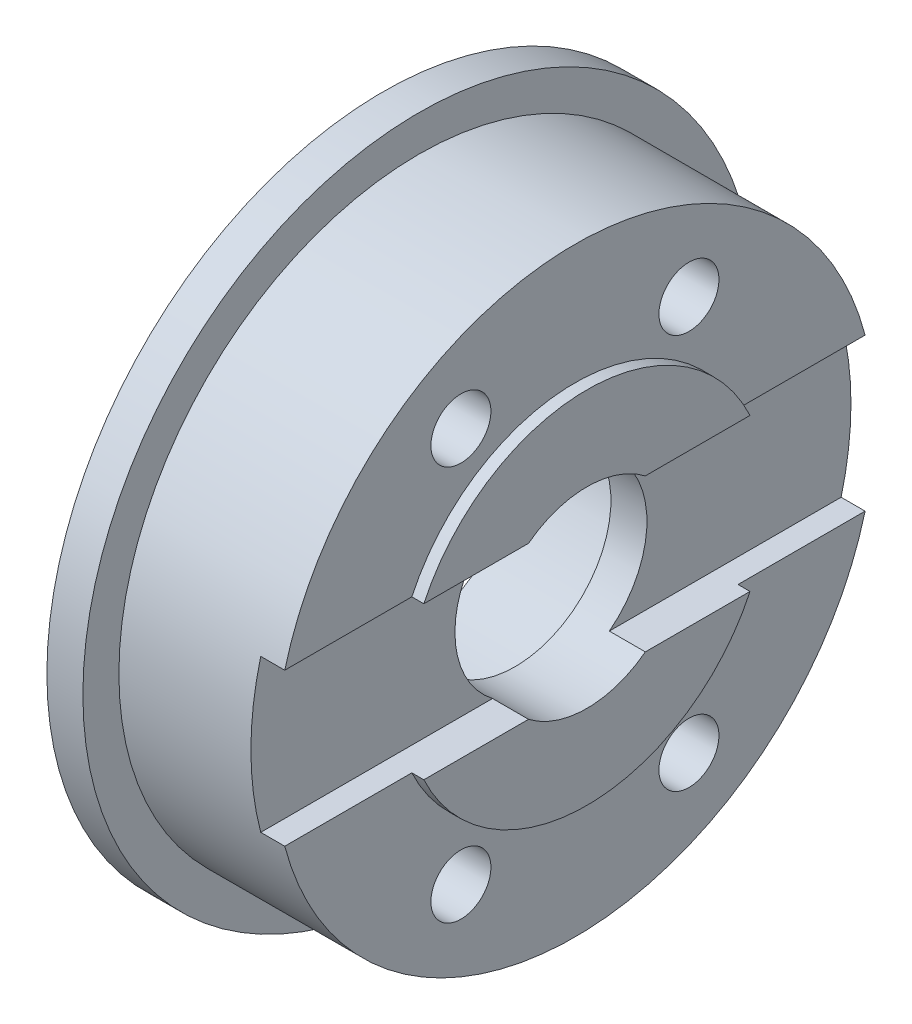
ISO-10303-21;
HEADER;
FILE_DESCRIPTION(('STEP AP214'),'2;1');
FILE_NAME('part.step','',(''),(''),'','','');
FILE_SCHEMA(('AUTOMOTIVE_DESIGN { 1 0 10303 214 1 1 1 1 }'));
ENDSEC;
DATA;
#1=APPLICATION_CONTEXT('core data for automotive mechanical design processes');
#2=APPLICATION_PROTOCOL_DEFINITION('international standard','automotive_design',2000,#1);
#3=PRODUCT_CONTEXT('',#1,'mechanical');
#4=PRODUCT('Part','Part','',(#3));
#5=PRODUCT_RELATED_PRODUCT_CATEGORY('part','',(#4));
#6=PRODUCT_DEFINITION_FORMATION('','',#4);
#7=PRODUCT_DEFINITION_CONTEXT('part definition',#1,'design');
#8=PRODUCT_DEFINITION('design','',#6,#7);
#9=PRODUCT_DEFINITION_SHAPE('','',#8);
#10=(LENGTH_UNIT() NAMED_UNIT(*) SI_UNIT(.MILLI.,.METRE.));
#11=(NAMED_UNIT(*) PLANE_ANGLE_UNIT() SI_UNIT($,.RADIAN.));
#12=(NAMED_UNIT(*) SI_UNIT($,.STERADIAN.) SOLID_ANGLE_UNIT());
#13=UNCERTAINTY_MEASURE_WITH_UNIT(LENGTH_MEASURE(1.E-05),#10,'distance_accuracy_value','');
#14=(GEOMETRIC_REPRESENTATION_CONTEXT(3) GLOBAL_UNCERTAINTY_ASSIGNED_CONTEXT((#13)) GLOBAL_UNIT_ASSIGNED_CONTEXT((#10,
#11,#12)) REPRESENTATION_CONTEXT('',''));
#15=CARTESIAN_POINT('',(0.,0.,0.));
#16=DIRECTION('',(0.,0.,1.));
#17=DIRECTION('',(1.,0.,0.));
#18=AXIS2_PLACEMENT_3D('',#15,#16,#17);
#19=CARTESIAN_POINT('',(-5.5,4.,0.));
#20=DIRECTION('',(-1.,0.,0.));
#21=DIRECTION('',(0.,0.,1.));
#22=AXIS2_PLACEMENT_3D('',#19,#20,#21);
#23=PLANE('',#22);
#24=DIRECTION('',(0.,0.,1.));
#25=VECTOR('',#24,1.);
#26=CARTESIAN_POINT('',(-5.5,3.175,0.));
#27=LINE('',#26,#25);
#28=CARTESIAN_POINT('',(-5.5,3.175,-6.79480500088119));
#29=VERTEX_POINT('',#28);
#30=CARTESIAN_POINT('',(-5.5,3.175,-2.43297657202037));
#31=VERTEX_POINT('',#30);
#32=EDGE_CURVE('E169',#29,#31,#27,.T.);
#33=ORIENTED_EDGE('',*,*,#32,.F.);
#34=CARTESIAN_POINT('',(-5.5,0.,0.));
#35=DIRECTION('',(-1.,0.,0.));
#36=DIRECTION('',(0.,0.,1.));
#37=AXIS2_PLACEMENT_3D('',#34,#35,#36);
#38=CIRCLE('',#37,7.5);
#39=CARTESIAN_POINT('',(-5.5,3.175,6.79480500088119));
#40=VERTEX_POINT('',#39);
#41=EDGE_CURVE('E181',#40,#29,#38,.T.);
#42=ORIENTED_EDGE('',*,*,#41,.F.);
#43=CARTESIAN_POINT('',(-5.5,3.175,2.43297657202037));
#44=VERTEX_POINT('',#43);
#45=EDGE_CURVE('E172',#44,#40,#27,.T.);
#46=ORIENTED_EDGE('',*,*,#45,.F.);
#47=CARTESIAN_POINT('',(-5.5,0.,0.));
#48=DIRECTION('',(-1.,0.,0.));
#49=DIRECTION('',(0.,0.,1.));
#50=AXIS2_PLACEMENT_3D('',#47,#48,#49);
#51=CIRCLE('',#50,4.);
#52=EDGE_CURVE('E211',#44,#31,#51,.T.);
#53=ORIENTED_EDGE('',*,*,#52,.T.);
#54=EDGE_LOOP('',(#33,#42,#46,#53));
#55=FACE_BOUND('',#54,.T.);
#56=ADVANCED_FACE('F45',(#55),#23,.F.);
#57=DIRECTION('',(0.,0.,-1.));
#58=VECTOR('',#57,1.);
#59=CARTESIAN_POINT('',(-5.5,-3.175,0.));
#60=LINE('',#59,#58);
#61=CARTESIAN_POINT('',(-5.5,-3.175,6.79480500088119));
#62=VERTEX_POINT('',#61);
#63=CARTESIAN_POINT('',(-5.5,-3.175,2.43297657202037));
#64=VERTEX_POINT('',#63);
#65=EDGE_CURVE('E153',#62,#64,#60,.T.);
#66=ORIENTED_EDGE('',*,*,#65,.F.);
#67=CARTESIAN_POINT('',(-5.5,-3.175,-6.79480500088119));
#68=VERTEX_POINT('',#67);
#69=EDGE_CURVE('E185',#68,#62,#38,.T.);
#70=ORIENTED_EDGE('',*,*,#69,.F.);
#71=CARTESIAN_POINT('',(-5.5,-3.175,-2.43297657202037));
#72=VERTEX_POINT('',#71);
#73=EDGE_CURVE('E59',#72,#68,#60,.T.);
#74=ORIENTED_EDGE('',*,*,#73,.F.);
#75=EDGE_CURVE('E210',#72,#64,#51,.T.);
#76=ORIENTED_EDGE('',*,*,#75,.T.);
#77=EDGE_LOOP('',(#66,#70,#74,#76));
#78=FACE_BOUND('',#77,.T.);
#79=ADVANCED_FACE('F323',(#78),#23,.F.);
#80=CARTESIAN_POINT('',(-22.0709534368071,0.,0.));
#81=DIRECTION('',(-1.,0.,0.));
#82=DIRECTION('',(0.,0.,1.));
#83=AXIS2_PLACEMENT_3D('',#80,#81,#82);
#84=CYLINDRICAL_SURFACE('',#83,4.);
#85=CARTESIAN_POINT('',(-8.5,0.,0.));
#86=DIRECTION('',(-1.,0.,0.));
#87=DIRECTION('',(0.,0.,1.));
#88=AXIS2_PLACEMENT_3D('',#85,#86,#87);
#89=CIRCLE('',#88,4.);
#90=CARTESIAN_POINT('',(-8.5,0.,4.));
#91=VERTEX_POINT('',#90);
#92=EDGE_CURVE('E207',#91,#91,#89,.T.);
#93=ORIENTED_EDGE('',*,*,#92,.T.);
#94=EDGE_LOOP('',(#93));
#95=FACE_BOUND('',#94,.T.);
#96=DIRECTION('',(-1.,0.,0.));
#97=VECTOR('',#96,1.);
#98=CARTESIAN_POINT('',(-22.0709534368071,3.175,2.43297657202037));
#99=LINE('',#98,#97);
#100=CARTESIAN_POINT('',(-7.,3.175,2.43297657202037));
#101=VERTEX_POINT('',#100);
#102=EDGE_CURVE('E176',#101,#44,#99,.F.);
#103=ORIENTED_EDGE('',*,*,#102,.F.);
#104=CARTESIAN_POINT('',(-7.,0.,0.));
#105=DIRECTION('',(1.,0.,0.));
#106=DIRECTION('',(0.,0.,-1.));
#107=AXIS2_PLACEMENT_3D('',#104,#105,#106);
#108=CIRCLE('',#107,4.);
#109=CARTESIAN_POINT('',(-7.,-3.175,2.43297657202037));
#110=VERTEX_POINT('',#109);
#111=EDGE_CURVE('E180',#110,#101,#108,.F.);
#112=ORIENTED_EDGE('',*,*,#111,.F.);
#113=DIRECTION('',(-1.,0.,0.));
#114=VECTOR('',#113,1.);
#115=CARTESIAN_POINT('',(-22.0709534368071,-3.175,2.43297657202037));
#116=LINE('',#115,#114);
#117=EDGE_CURVE('E145',#64,#110,#116,.T.);
#118=ORIENTED_EDGE('',*,*,#117,.F.);
#119=ORIENTED_EDGE('',*,*,#75,.F.);
#120=DIRECTION('',(-1.,0.,0.));
#121=VECTOR('',#120,1.);
#122=CARTESIAN_POINT('',(-22.0709534368071,-3.175,-2.43297657202037));
#123=LINE('',#122,#121);
#124=CARTESIAN_POINT('',(-7.,-3.175,-2.43297657202037));
#125=VERTEX_POINT('',#124);
#126=EDGE_CURVE('E162',#125,#72,#123,.F.);
#127=ORIENTED_EDGE('',*,*,#126,.F.);
#128=CARTESIAN_POINT('',(-7.,3.175,-2.43297657202037));
#129=VERTEX_POINT('',#128);
#130=EDGE_CURVE('E178',#129,#125,#108,.F.);
#131=ORIENTED_EDGE('',*,*,#130,.F.);
#132=DIRECTION('',(-1.,0.,0.));
#133=VECTOR('',#132,1.);
#134=CARTESIAN_POINT('',(-22.0709534368071,3.175,-2.43297657202037));
#135=LINE('',#134,#133);
#136=EDGE_CURVE('E171',#31,#129,#135,.T.);
#137=ORIENTED_EDGE('',*,*,#136,.F.);
#138=ORIENTED_EDGE('',*,*,#52,.F.);
#139=EDGE_LOOP('',(#103,#112,#118,#119,#127,#131,#137,#138));
#140=FACE_BOUND('',#139,.T.);
#141=ADVANCED_FACE('F252',(#95,#140),#84,.F.);
#142=CARTESIAN_POINT('',(-22.0709534368071,0.,0.));
#143=DIRECTION('',(-1.,0.,0.));
#144=DIRECTION('',(0.,0.,1.));
#145=AXIS2_PLACEMENT_3D('',#142,#143,#144);
#146=CYLINDRICAL_SURFACE('',#145,12.5);
#147=CARTESIAN_POINT('',(-12.5,0.,0.));
#148=DIRECTION('',(-1.,0.,0.));
#149=DIRECTION('',(0.,0.,1.));
#150=AXIS2_PLACEMENT_3D('',#147,#148,#149);
#151=CIRCLE('',#150,12.5);
#152=CARTESIAN_POINT('',(-12.5,0.,12.5));
#153=VERTEX_POINT('',#152);
#154=EDGE_CURVE('E192',#153,#153,#151,.T.);
#155=ORIENTED_EDGE('',*,*,#154,.F.);
#156=EDGE_LOOP('',(#155));
#157=FACE_BOUND('',#156,.T.);
#158=DIRECTION('',(-1.,0.,0.));
#159=VECTOR('',#158,1.);
#160=CARTESIAN_POINT('',(-22.0709534368071,3.175,12.0900527294135));
#161=LINE('',#160,#159);
#162=CARTESIAN_POINT('',(-6.,3.175,12.0900527294135));
#163=VERTEX_POINT('',#162);
#164=CARTESIAN_POINT('',(-7.,3.175,12.0900527294135));
#165=VERTEX_POINT('',#164);
#166=EDGE_CURVE('E174',#163,#165,#161,.T.);
#167=ORIENTED_EDGE('',*,*,#166,.F.);
#168=CARTESIAN_POINT('',(-6.,0.,0.));
#169=DIRECTION('',(-1.,0.,0.));
#170=DIRECTION('',(0.,0.,1.));
#171=AXIS2_PLACEMENT_3D('',#168,#169,#170);
#172=CIRCLE('',#171,12.5);
#173=CARTESIAN_POINT('',(-6.,3.175,-12.0900527294135));
#174=VERTEX_POINT('',#173);
#175=EDGE_CURVE('E189',#163,#174,#172,.T.);
#176=ORIENTED_EDGE('',*,*,#175,.T.);
#177=DIRECTION('',(-1.,0.,0.));
#178=VECTOR('',#177,1.);
#179=CARTESIAN_POINT('',(-22.0709534368071,3.175,-12.0900527294135));
#180=LINE('',#179,#178);
#181=CARTESIAN_POINT('',(-7.,3.175,-12.0900527294135));
#182=VERTEX_POINT('',#181);
#183=EDGE_CURVE('E166',#182,#174,#180,.F.);
#184=ORIENTED_EDGE('',*,*,#183,.F.);
#185=CARTESIAN_POINT('',(-7.,0.,0.));
#186=DIRECTION('',(1.,0.,0.));
#187=DIRECTION('',(0.,0.,-1.));
#188=AXIS2_PLACEMENT_3D('',#185,#186,#187);
#189=CIRCLE('',#188,12.5);
#190=CARTESIAN_POINT('',(-7.,-3.175,-12.0900527294135));
#191=VERTEX_POINT('',#190);
#192=EDGE_CURVE('E48',#191,#182,#189,.T.);
#193=ORIENTED_EDGE('',*,*,#192,.F.);
#194=DIRECTION('',(-1.,0.,0.));
#195=VECTOR('',#194,1.);
#196=CARTESIAN_POINT('',(-22.0709534368071,-3.175,-12.0900527294135));
#197=LINE('',#196,#195);
#198=CARTESIAN_POINT('',(-6.,-3.175,-12.0900527294135));
#199=VERTEX_POINT('',#198);
#200=EDGE_CURVE('E160',#199,#191,#197,.T.);
#201=ORIENTED_EDGE('',*,*,#200,.F.);
#202=CARTESIAN_POINT('',(-6.,-3.175,12.0900527294135));
#203=VERTEX_POINT('',#202);
#204=EDGE_CURVE('E152',#199,#203,#172,.T.);
#205=ORIENTED_EDGE('',*,*,#204,.T.);
#206=DIRECTION('',(-1.,0.,0.));
#207=VECTOR('',#206,1.);
#208=CARTESIAN_POINT('',(-22.0709534368071,-3.175,12.0900527294135));
#209=LINE('',#208,#207);
#210=CARTESIAN_POINT('',(-7.,-3.175,12.0900527294135));
#211=VERTEX_POINT('',#210);
#212=EDGE_CURVE('E143',#211,#203,#209,.F.);
#213=ORIENTED_EDGE('',*,*,#212,.F.);
#214=EDGE_CURVE('E11',#165,#211,#189,.T.);
#215=ORIENTED_EDGE('',*,*,#214,.F.);
#216=EDGE_LOOP('',(#167,#176,#184,#193,#201,#205,#213,#215));
#217=FACE_BOUND('',#216,.T.);
#218=ADVANCED_FACE('F149',(#157,#217),#146,.T.);
#219=CARTESIAN_POINT('',(-6.,12.5,0.));
#220=DIRECTION('',(-1.,0.,0.));
#221=DIRECTION('',(0.,0.,1.));
#222=AXIS2_PLACEMENT_3D('',#219,#220,#221);
#223=PLANE('',#222);
#224=CARTESIAN_POINT('',(-6.,8.22724133595217,-4.75));
#225=DIRECTION('',(-1.,0.,0.));
#226=DIRECTION('',(0.,0.,1.));
#227=AXIS2_PLACEMENT_3D('',#224,#225,#226);
#228=CIRCLE('',#227,1.24999999999999);
#229=CARTESIAN_POINT('',(-6.,8.22724133595217,-3.50000000000001));
#230=VERTEX_POINT('',#229);
#231=EDGE_CURVE('E263',#230,#230,#228,.T.);
#232=ORIENTED_EDGE('',*,*,#231,.T.);
#233=EDGE_LOOP('',(#232));
#234=FACE_BOUND('',#233,.T.);
#235=CARTESIAN_POINT('',(-6.,8.22724133595217,4.75));
#236=DIRECTION('',(-1.,0.,0.));
#237=DIRECTION('',(0.,0.,1.));
#238=AXIS2_PLACEMENT_3D('',#235,#236,#237);
#239=CIRCLE('',#238,1.24999999999999);
#240=CARTESIAN_POINT('',(-6.,8.22724133595217,6.));
#241=VERTEX_POINT('',#240);
#242=EDGE_CURVE('E257',#241,#241,#239,.T.);
#243=ORIENTED_EDGE('',*,*,#242,.T.);
#244=EDGE_LOOP('',(#243));
#245=FACE_BOUND('',#244,.T.);
#246=DIRECTION('',(0.,0.,1.));
#247=VECTOR('',#246,1.);
#248=CARTESIAN_POINT('',(-6.,3.175,0.));
#249=LINE('',#248,#247);
#250=CARTESIAN_POINT('',(-6.,3.175,-6.79480500088119));
#251=VERTEX_POINT('',#250);
#252=EDGE_CURVE('E164',#174,#251,#249,.T.);
#253=ORIENTED_EDGE('',*,*,#252,.F.);
#254=ORIENTED_EDGE('',*,*,#175,.F.);
#255=CARTESIAN_POINT('',(-6.,3.175,6.79480500088119));
#256=VERTEX_POINT('',#255);
#257=EDGE_CURVE('E167',#256,#163,#249,.T.);
#258=ORIENTED_EDGE('',*,*,#257,.F.);
#259=CARTESIAN_POINT('',(-6.,0.,0.));
#260=DIRECTION('',(-1.,0.,0.));
#261=DIRECTION('',(0.,0.,1.));
#262=AXIS2_PLACEMENT_3D('',#259,#260,#261);
#263=CIRCLE('',#262,7.5);
#264=EDGE_CURVE('E186',#256,#251,#263,.T.);
#265=ORIENTED_EDGE('',*,*,#264,.T.);
#266=EDGE_LOOP('',(#253,#254,#258,#265));
#267=FACE_BOUND('',#266,.T.);
#268=ADVANCED_FACE('F240',(#234,#245,#267),#223,.F.);
#269=CARTESIAN_POINT('',(-6.,-8.22724133595217,4.75));
#270=DIRECTION('',(-1.,0.,0.));
#271=DIRECTION('',(0.,0.,1.));
#272=AXIS2_PLACEMENT_3D('',#269,#270,#271);
#273=CIRCLE('',#272,1.25);
#274=CARTESIAN_POINT('',(-6.,-8.22724133595217,6.));
#275=VERTEX_POINT('',#274);
#276=EDGE_CURVE('E275',#275,#275,#273,.T.);
#277=ORIENTED_EDGE('',*,*,#276,.T.);
#278=EDGE_LOOP('',(#277));
#279=FACE_BOUND('',#278,.T.);
#280=CARTESIAN_POINT('',(-6.,-8.22724133595217,-4.75));
#281=DIRECTION('',(-1.,0.,0.));
#282=DIRECTION('',(0.,0.,1.));
#283=AXIS2_PLACEMENT_3D('',#280,#281,#282);
#284=CIRCLE('',#283,1.25);
#285=CARTESIAN_POINT('',(-6.,-8.22724133595217,-3.5));
#286=VERTEX_POINT('',#285);
#287=EDGE_CURVE('E269',#286,#286,#284,.T.);
#288=ORIENTED_EDGE('',*,*,#287,.T.);
#289=EDGE_LOOP('',(#288));
#290=FACE_BOUND('',#289,.T.);
#291=DIRECTION('',(0.,0.,-1.));
#292=VECTOR('',#291,1.);
#293=CARTESIAN_POINT('',(-6.,-3.175,0.));
#294=LINE('',#293,#292);
#295=CARTESIAN_POINT('',(-6.,-3.175,6.79480500088119));
#296=VERTEX_POINT('',#295);
#297=EDGE_CURVE('E67',#203,#296,#294,.T.);
#298=ORIENTED_EDGE('',*,*,#297,.F.);
#299=ORIENTED_EDGE('',*,*,#204,.F.);
#300=CARTESIAN_POINT('',(-6.,-3.175,-6.79480500088119));
#301=VERTEX_POINT('',#300);
#302=EDGE_CURVE('E157',#301,#199,#294,.T.);
#303=ORIENTED_EDGE('',*,*,#302,.F.);
#304=EDGE_CURVE('E184',#301,#296,#263,.T.);
#305=ORIENTED_EDGE('',*,*,#304,.T.);
#306=EDGE_LOOP('',(#298,#299,#303,#305));
#307=FACE_BOUND('',#306,.T.);
#308=ADVANCED_FACE('F320',(#279,#290,#307),#223,.F.);
#309=CARTESIAN_POINT('',(-22.0709534368071,0.,0.));
#310=DIRECTION('',(-1.,0.,0.));
#311=DIRECTION('',(0.,0.,1.));
#312=AXIS2_PLACEMENT_3D('',#309,#310,#311);
#313=CYLINDRICAL_SURFACE('',#312,7.5);
#314=DIRECTION('',(-1.,0.,0.));
#315=VECTOR('',#314,1.);
#316=CARTESIAN_POINT('',(-22.0709534368071,3.175,6.79480500088119));
#317=LINE('',#316,#315);
#318=EDGE_CURVE('E219',#40,#256,#317,.T.);
#319=ORIENTED_EDGE('',*,*,#318,.F.);
#320=ORIENTED_EDGE('',*,*,#41,.T.);
#321=DIRECTION('',(-1.,0.,0.));
#322=VECTOR('',#321,1.);
#323=CARTESIAN_POINT('',(-22.0709534368071,3.175,-6.79480500088119));
#324=LINE('',#323,#322);
#325=EDGE_CURVE('E218',#251,#29,#324,.F.);
#326=ORIENTED_EDGE('',*,*,#325,.F.);
#327=ORIENTED_EDGE('',*,*,#264,.F.);
#328=EDGE_LOOP('',(#319,#320,#326,#327));
#329=FACE_BOUND('',#328,.T.);
#330=ADVANCED_FACE('F245',(#329),#313,.T.);
#331=DIRECTION('',(-1.,0.,0.));
#332=VECTOR('',#331,1.);
#333=CARTESIAN_POINT('',(-22.0709534368071,-3.175,-6.79480500088119));
#334=LINE('',#333,#332);
#335=EDGE_CURVE('E216',#68,#301,#334,.T.);
#336=ORIENTED_EDGE('',*,*,#335,.F.);
#337=ORIENTED_EDGE('',*,*,#69,.T.);
#338=DIRECTION('',(-1.,0.,0.));
#339=VECTOR('',#338,1.);
#340=CARTESIAN_POINT('',(-22.0709534368071,-3.175,6.79480500088119));
#341=LINE('',#340,#339);
#342=EDGE_CURVE('E214',#296,#62,#341,.F.);
#343=ORIENTED_EDGE('',*,*,#342,.F.);
#344=ORIENTED_EDGE('',*,*,#304,.F.);
#345=EDGE_LOOP('',(#336,#337,#343,#344));
#346=FACE_BOUND('',#345,.T.);
#347=ADVANCED_FACE('F339',(#346),#313,.T.);
#348=CARTESIAN_POINT('',(-8.5,6.5,0.));
#349=DIRECTION('',(1.,0.,0.));
#350=DIRECTION('',(0.,0.,-1.));
#351=AXIS2_PLACEMENT_3D('',#348,#349,#350);
#352=PLANE('',#351);
#353=ORIENTED_EDGE('',*,*,#92,.F.);
#354=EDGE_LOOP('',(#353));
#355=FACE_BOUND('',#354,.T.);
#356=CARTESIAN_POINT('',(-8.5,0.,0.));
#357=DIRECTION('',(-1.,0.,0.));
#358=DIRECTION('',(0.,0.,1.));
#359=AXIS2_PLACEMENT_3D('',#356,#357,#358);
#360=CIRCLE('',#359,6.5);
#361=CARTESIAN_POINT('',(-8.5,0.,6.5));
#362=VERTEX_POINT('',#361);
#363=EDGE_CURVE('E204',#362,#362,#360,.T.);
#364=ORIENTED_EDGE('',*,*,#363,.T.);
#365=EDGE_LOOP('',(#364));
#366=FACE_BOUND('',#365,.T.);
#367=ADVANCED_FACE('F509',(#355,#366),#352,.F.);
#368=CARTESIAN_POINT('',(-22.0709534368071,0.,0.));
#369=DIRECTION('',(-1.,0.,0.));
#370=DIRECTION('',(0.,0.,1.));
#371=AXIS2_PLACEMENT_3D('',#368,#369,#370);
#372=CYLINDRICAL_SURFACE('',#371,6.5);
#373=ORIENTED_EDGE('',*,*,#363,.F.);
#374=EDGE_LOOP('',(#373));
#375=FACE_BOUND('',#374,.T.);
#376=CARTESIAN_POINT('',(-14.,0.,0.));
#377=DIRECTION('',(-1.,0.,0.));
#378=DIRECTION('',(0.,0.,1.));
#379=AXIS2_PLACEMENT_3D('',#376,#377,#378);
#380=CIRCLE('',#379,6.5);
#381=CARTESIAN_POINT('',(-14.,0.,6.5));
#382=VERTEX_POINT('',#381);
#383=EDGE_CURVE('E201',#382,#382,#380,.T.);
#384=ORIENTED_EDGE('',*,*,#383,.T.);
#385=EDGE_LOOP('',(#384));
#386=FACE_BOUND('',#385,.T.);
#387=ADVANCED_FACE('F289',(#375,#386),#372,.F.);
#388=CARTESIAN_POINT('',(-14.,14.,0.));
#389=DIRECTION('',(1.,0.,0.));
#390=DIRECTION('',(0.,0.,-1.));
#391=AXIS2_PLACEMENT_3D('',#388,#389,#390);
#392=PLANE('',#391);
#393=CARTESIAN_POINT('',(-14.,-8.22724133595217,4.75));
#394=DIRECTION('',(-1.,0.,0.));
#395=DIRECTION('',(0.,0.,1.));
#396=AXIS2_PLACEMENT_3D('',#393,#394,#395);
#397=CIRCLE('',#396,1.25);
#398=CARTESIAN_POINT('',(-14.,-8.22724133595217,6.));
#399=VERTEX_POINT('',#398);
#400=EDGE_CURVE('E278',#399,#399,#397,.T.);
#401=ORIENTED_EDGE('',*,*,#400,.F.);
#402=EDGE_LOOP('',(#401));
#403=FACE_BOUND('',#402,.T.);
#404=CARTESIAN_POINT('',(-14.,-8.22724133595217,-4.75));
#405=DIRECTION('',(-1.,0.,0.));
#406=DIRECTION('',(0.,0.,1.));
#407=AXIS2_PLACEMENT_3D('',#404,#405,#406);
#408=CIRCLE('',#407,1.25);
#409=CARTESIAN_POINT('',(-14.,-8.22724133595217,-3.5));
#410=VERTEX_POINT('',#409);
#411=EDGE_CURVE('E272',#410,#410,#408,.T.);
#412=ORIENTED_EDGE('',*,*,#411,.F.);
#413=EDGE_LOOP('',(#412));
#414=FACE_BOUND('',#413,.T.);
#415=CARTESIAN_POINT('',(-14.,8.22724133595217,-4.75));
#416=DIRECTION('',(-1.,0.,0.));
#417=DIRECTION('',(0.,0.,1.));
#418=AXIS2_PLACEMENT_3D('',#415,#416,#417);
#419=CIRCLE('',#418,1.25);
#420=CARTESIAN_POINT('',(-14.,8.22724133595217,-3.50000000000001));
#421=VERTEX_POINT('',#420);
#422=EDGE_CURVE('E266',#421,#421,#419,.T.);
#423=ORIENTED_EDGE('',*,*,#422,.F.);
#424=EDGE_LOOP('',(#423));
#425=FACE_BOUND('',#424,.T.);
#426=CARTESIAN_POINT('',(-14.,8.22724133595217,4.75));
#427=DIRECTION('',(-1.,0.,0.));
#428=DIRECTION('',(0.,0.,1.));
#429=AXIS2_PLACEMENT_3D('',#426,#427,#428);
#430=CIRCLE('',#429,1.25);
#431=CARTESIAN_POINT('',(-14.,8.22724133595217,6.));
#432=VERTEX_POINT('',#431);
#433=EDGE_CURVE('E260',#432,#432,#430,.T.);
#434=ORIENTED_EDGE('',*,*,#433,.F.);
#435=EDGE_LOOP('',(#434));
#436=FACE_BOUND('',#435,.T.);
#437=ORIENTED_EDGE('',*,*,#383,.F.);
#438=EDGE_LOOP('',(#437));
#439=FACE_BOUND('',#438,.T.);
#440=CARTESIAN_POINT('',(-14.,0.,0.));
#441=DIRECTION('',(-1.,0.,0.));
#442=DIRECTION('',(0.,0.,1.));
#443=AXIS2_PLACEMENT_3D('',#440,#441,#442);
#444=CIRCLE('',#443,14.);
#445=CARTESIAN_POINT('',(-14.,0.,14.));
#446=VERTEX_POINT('',#445);
#447=EDGE_CURVE('E198',#446,#446,#444,.T.);
#448=ORIENTED_EDGE('',*,*,#447,.T.);
#449=EDGE_LOOP('',(#448));
#450=FACE_BOUND('',#449,.T.);
#451=ADVANCED_FACE('F285',(#403,#414,#425,#436,#439,#450),#392,.F.);
#452=CARTESIAN_POINT('',(-22.0709534368071,0.,0.));
#453=DIRECTION('',(-1.,0.,0.));
#454=DIRECTION('',(0.,0.,1.));
#455=AXIS2_PLACEMENT_3D('',#452,#453,#454);
#456=CYLINDRICAL_SURFACE('',#455,14.);
#457=ORIENTED_EDGE('',*,*,#447,.F.);
#458=EDGE_LOOP('',(#457));
#459=FACE_BOUND('',#458,.T.);
#460=CARTESIAN_POINT('',(-12.5,0.,0.));
#461=DIRECTION('',(-1.,0.,0.));
#462=DIRECTION('',(0.,0.,1.));
#463=AXIS2_PLACEMENT_3D('',#460,#461,#462);
#464=CIRCLE('',#463,14.);
#465=CARTESIAN_POINT('',(-12.5,0.,14.));
#466=VERTEX_POINT('',#465);
#467=EDGE_CURVE('E195',#466,#466,#464,.T.);
#468=ORIENTED_EDGE('',*,*,#467,.T.);
#469=EDGE_LOOP('',(#468));
#470=FACE_BOUND('',#469,.T.);
#471=ADVANCED_FACE('F288',(#459,#470),#456,.T.);
#472=CARTESIAN_POINT('',(-12.5,12.5,0.));
#473=DIRECTION('',(-1.,0.,0.));
#474=DIRECTION('',(0.,0.,1.));
#475=AXIS2_PLACEMENT_3D('',#472,#473,#474);
#476=PLANE('',#475);
#477=ORIENTED_EDGE('',*,*,#467,.F.);
#478=EDGE_LOOP('',(#477));
#479=FACE_BOUND('',#478,.T.);
#480=ORIENTED_EDGE('',*,*,#154,.T.);
#481=EDGE_LOOP('',(#480));
#482=FACE_BOUND('',#481,.T.);
#483=ADVANCED_FACE('F303',(#479,#482),#476,.F.);
#484=CARTESIAN_POINT('',(36.3610170492095,3.175,13.6352255206872));
#485=DIRECTION('',(0.,-1.,0.));
#486=DIRECTION('',(0.,0.,-1.));
#487=AXIS2_PLACEMENT_3D('',#484,#485,#486);
#488=PLANE('',#487);
#489=ORIENTED_EDGE('',*,*,#102,.T.);
#490=ORIENTED_EDGE('',*,*,#45,.T.);
#491=ORIENTED_EDGE('',*,*,#318,.T.);
#492=ORIENTED_EDGE('',*,*,#257,.T.);
#493=ORIENTED_EDGE('',*,*,#166,.T.);
#494=DIRECTION('',(0.,0.,1.));
#495=VECTOR('',#494,1.);
#496=CARTESIAN_POINT('',(-7.,3.175,13.6352255206872));
#497=LINE('',#496,#495);
#498=EDGE_CURVE('E138',#101,#165,#497,.T.);
#499=ORIENTED_EDGE('',*,*,#498,.F.);
#500=EDGE_LOOP('',(#489,#490,#491,#492,#493,#499));
#501=FACE_BOUND('',#500,.T.);
#502=ADVANCED_FACE('F309',(#501),#488,.T.);
#503=CARTESIAN_POINT('',(36.3610170492095,-3.175,13.6352255206872));
#504=DIRECTION('',(0.,1.,0.));
#505=DIRECTION('',(0.,0.,1.));
#506=AXIS2_PLACEMENT_3D('',#503,#504,#505);
#507=PLANE('',#506);
#508=ORIENTED_EDGE('',*,*,#117,.T.);
#509=DIRECTION('',(0.,0.,-1.));
#510=VECTOR('',#509,1.);
#511=CARTESIAN_POINT('',(-7.,-3.175,13.6352255206872));
#512=LINE('',#511,#510);
#513=EDGE_CURVE('E135',#211,#110,#512,.T.);
#514=ORIENTED_EDGE('',*,*,#513,.F.);
#515=ORIENTED_EDGE('',*,*,#212,.T.);
#516=ORIENTED_EDGE('',*,*,#297,.T.);
#517=ORIENTED_EDGE('',*,*,#342,.T.);
#518=ORIENTED_EDGE('',*,*,#65,.T.);
#519=EDGE_LOOP('',(#508,#514,#515,#516,#517,#518));
#520=FACE_BOUND('',#519,.T.);
#521=ADVANCED_FACE('F142',(#520),#507,.T.);
#522=CARTESIAN_POINT('',(-7.,0.,0.));
#523=DIRECTION('',(1.,0.,0.));
#524=DIRECTION('',(0.,0.,-1.));
#525=AXIS2_PLACEMENT_3D('',#522,#523,#524);
#526=PLANE('',#525);
#527=ORIENTED_EDGE('',*,*,#111,.T.);
#528=ORIENTED_EDGE('',*,*,#498,.T.);
#529=ORIENTED_EDGE('',*,*,#214,.T.);
#530=ORIENTED_EDGE('',*,*,#513,.T.);
#531=EDGE_LOOP('',(#527,#528,#529,#530));
#532=FACE_BOUND('',#531,.T.);
#533=ADVANCED_FACE('F134',(#532),#526,.T.);
#534=ORIENTED_EDGE('',*,*,#130,.T.);
#535=EDGE_CURVE('E146',#125,#191,#512,.T.);
#536=ORIENTED_EDGE('',*,*,#535,.T.);
#537=ORIENTED_EDGE('',*,*,#192,.T.);
#538=EDGE_CURVE('E229',#182,#129,#497,.T.);
#539=ORIENTED_EDGE('',*,*,#538,.T.);
#540=EDGE_LOOP('',(#534,#536,#537,#539));
#541=FACE_BOUND('',#540,.T.);
#542=ADVANCED_FACE('F228',(#541),#526,.T.);
#543=ORIENTED_EDGE('',*,*,#136,.T.);
#544=ORIENTED_EDGE('',*,*,#538,.F.);
#545=ORIENTED_EDGE('',*,*,#183,.T.);
#546=ORIENTED_EDGE('',*,*,#252,.T.);
#547=ORIENTED_EDGE('',*,*,#325,.T.);
#548=ORIENTED_EDGE('',*,*,#32,.T.);
#549=EDGE_LOOP('',(#543,#544,#545,#546,#547,#548));
#550=FACE_BOUND('',#549,.T.);
#551=ADVANCED_FACE('F234',(#550),#488,.T.);
#552=ORIENTED_EDGE('',*,*,#126,.T.);
#553=ORIENTED_EDGE('',*,*,#73,.T.);
#554=ORIENTED_EDGE('',*,*,#335,.T.);
#555=ORIENTED_EDGE('',*,*,#302,.T.);
#556=ORIENTED_EDGE('',*,*,#200,.T.);
#557=ORIENTED_EDGE('',*,*,#535,.F.);
#558=EDGE_LOOP('',(#552,#553,#554,#555,#556,#557));
#559=FACE_BOUND('',#558,.T.);
#560=ADVANCED_FACE('F255',(#559),#507,.T.);
#561=CARTESIAN_POINT('',(-14.,8.22724133595217,4.75));
#562=DIRECTION('',(-1.,0.,0.));
#563=DIRECTION('',(0.,0.,1.));
#564=AXIS2_PLACEMENT_3D('',#561,#562,#563);
#565=CYLINDRICAL_SURFACE('',#564,1.24999999999999);
#566=ORIENTED_EDGE('',*,*,#433,.T.);
#567=EDGE_LOOP('',(#566));
#568=FACE_BOUND('',#567,.T.);
#569=ORIENTED_EDGE('',*,*,#242,.F.);
#570=EDGE_LOOP('',(#569));
#571=FACE_BOUND('',#570,.T.);
#572=ADVANCED_FACE('F356',(#568,#571),#565,.F.);
#573=CARTESIAN_POINT('',(-14.,8.22724133595217,-4.75));
#574=DIRECTION('',(-1.,0.,0.));
#575=DIRECTION('',(0.,0.,1.));
#576=AXIS2_PLACEMENT_3D('',#573,#574,#575);
#577=CYLINDRICAL_SURFACE('',#576,1.24999999999999);
#578=ORIENTED_EDGE('',*,*,#422,.T.);
#579=EDGE_LOOP('',(#578));
#580=FACE_BOUND('',#579,.T.);
#581=ORIENTED_EDGE('',*,*,#231,.F.);
#582=EDGE_LOOP('',(#581));
#583=FACE_BOUND('',#582,.T.);
#584=ADVANCED_FACE('F365',(#580,#583),#577,.F.);
#585=CARTESIAN_POINT('',(-14.,-8.22724133595217,-4.75));
#586=DIRECTION('',(-1.,0.,0.));
#587=DIRECTION('',(0.,0.,1.));
#588=AXIS2_PLACEMENT_3D('',#585,#586,#587);
#589=CYLINDRICAL_SURFACE('',#588,1.25);
#590=ORIENTED_EDGE('',*,*,#411,.T.);
#591=EDGE_LOOP('',(#590));
#592=FACE_BOUND('',#591,.T.);
#593=ORIENTED_EDGE('',*,*,#287,.F.);
#594=EDGE_LOOP('',(#593));
#595=FACE_BOUND('',#594,.T.);
#596=ADVANCED_FACE('F369',(#592,#595),#589,.F.);
#597=CARTESIAN_POINT('',(-14.,-8.22724133595217,4.75));
#598=DIRECTION('',(-1.,0.,0.));
#599=DIRECTION('',(0.,0.,1.));
#600=AXIS2_PLACEMENT_3D('',#597,#598,#599);
#601=CYLINDRICAL_SURFACE('',#600,1.25);
#602=ORIENTED_EDGE('',*,*,#400,.T.);
#603=EDGE_LOOP('',(#602));
#604=FACE_BOUND('',#603,.T.);
#605=ORIENTED_EDGE('',*,*,#276,.F.);
#606=EDGE_LOOP('',(#605));
#607=FACE_BOUND('',#606,.T.);
#608=ADVANCED_FACE('F282',(#604,#607),#601,.F.);
#609=CLOSED_SHELL('',(#56,#79,#141,#218,#268,#308,#330,#347,#367,#387,#451,#471,#483,#502,#521,
#533,#542,#551,#560,#572,#584,#596,#608));
#610=MANIFOLD_SOLID_BREP('B2',#609);
#611=ADVANCED_BREP_SHAPE_REPRESENTATION('',(#18,#610),#14);
#612=SHAPE_DEFINITION_REPRESENTATION(#9,#611);
ENDSEC;
END-ISO-10303-21;
